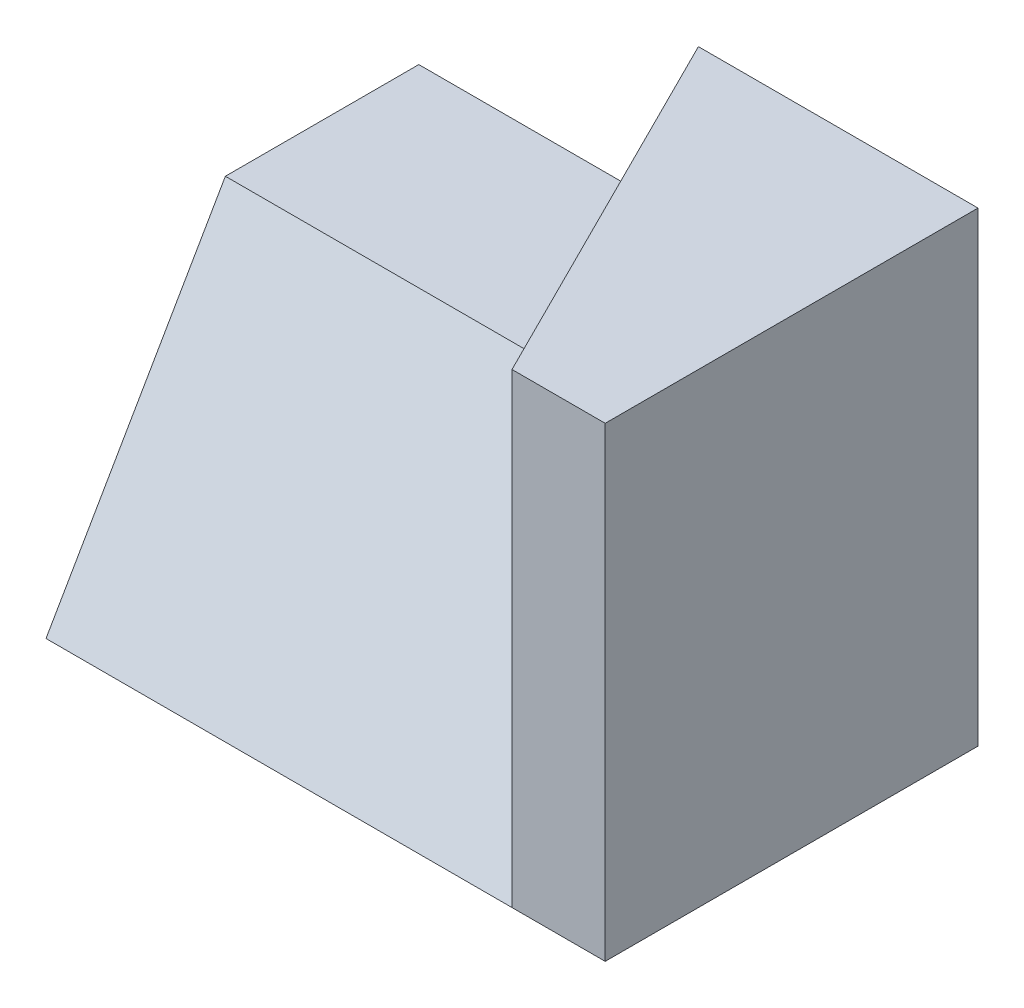
ISO-10303-21;
HEADER;
FILE_DESCRIPTION(('STEP AP214'),'2;1');
FILE_NAME('part.step','',(''),(''),'','','');
FILE_SCHEMA(('AUTOMOTIVE_DESIGN { 1 0 10303 214 1 1 1 1 }'));
ENDSEC;
DATA;
#1=APPLICATION_CONTEXT('core data for automotive mechanical design processes');
#2=APPLICATION_PROTOCOL_DEFINITION('international standard','automotive_design',2000,#1);
#3=PRODUCT_CONTEXT('',#1,'mechanical');
#4=PRODUCT('Part','Part','',(#3));
#5=PRODUCT_RELATED_PRODUCT_CATEGORY('part','',(#4));
#6=PRODUCT_DEFINITION_FORMATION('','',#4);
#7=PRODUCT_DEFINITION_CONTEXT('part definition',#1,'design');
#8=PRODUCT_DEFINITION('design','',#6,#7);
#9=PRODUCT_DEFINITION_SHAPE('','',#8);
#10=(LENGTH_UNIT() NAMED_UNIT(*) SI_UNIT(.MILLI.,.METRE.));
#11=(NAMED_UNIT(*) PLANE_ANGLE_UNIT() SI_UNIT($,.RADIAN.));
#12=(NAMED_UNIT(*) SI_UNIT($,.STERADIAN.) SOLID_ANGLE_UNIT());
#13=UNCERTAINTY_MEASURE_WITH_UNIT(LENGTH_MEASURE(1.E-05),#10,'distance_accuracy_value','');
#14=(GEOMETRIC_REPRESENTATION_CONTEXT(3) GLOBAL_UNCERTAINTY_ASSIGNED_CONTEXT((#13)) GLOBAL_UNIT_ASSIGNED_CONTEXT((#10,
#11,#12)) REPRESENTATION_CONTEXT('',''));
#15=CARTESIAN_POINT('',(0.,0.,0.));
#16=DIRECTION('',(0.,0.,1.));
#17=DIRECTION('',(1.,0.,0.));
#18=AXIS2_PLACEMENT_3D('',#15,#16,#17);
#19=CARTESIAN_POINT('',(0.,50.,-60.));
#20=DIRECTION('',(0.,-1.,0.));
#21=DIRECTION('',(0.,0.,-1.));
#22=AXIS2_PLACEMENT_3D('',#19,#20,#21);
#23=PLANE('',#22);
#24=DIRECTION('',(0.447213595499958,0.,0.894427190999916));
#25=VECTOR('',#24,1.);
#26=CARTESIAN_POINT('',(36.,50.,-78.));
#27=LINE('',#26,#25);
#28=CARTESIAN_POINT('',(45.,50.,-60.));
#29=VERTEX_POINT('',#28);
#30=CARTESIAN_POINT('',(60.5662432702594,50.,-28.8675134594811));
#31=VERTEX_POINT('',#30);
#32=EDGE_CURVE('E46',#29,#31,#27,.T.);
#33=ORIENTED_EDGE('',*,*,#32,.F.);
#34=DIRECTION('',(-1.,0.,0.));
#35=VECTOR('',#34,1.);
#36=CARTESIAN_POINT('',(0.,50.,-60.));
#37=LINE('',#36,#35);
#38=CARTESIAN_POINT('',(0.,50.,-60.));
#39=VERTEX_POINT('',#38);
#40=EDGE_CURVE('E111',#29,#39,#37,.T.);
#41=ORIENTED_EDGE('',*,*,#40,.T.);
#42=DIRECTION('',(0.,0.,1.));
#43=VECTOR('',#42,1.);
#44=CARTESIAN_POINT('',(0.,50.,0.));
#45=LINE('',#44,#43);
#46=CARTESIAN_POINT('',(0.,50.,-28.8675134594811));
#47=VERTEX_POINT('',#46);
#48=EDGE_CURVE('E124',#39,#47,#45,.T.);
#49=ORIENTED_EDGE('',*,*,#48,.T.);
#50=DIRECTION('',(1.,0.,0.));
#51=VECTOR('',#50,1.);
#52=CARTESIAN_POINT('',(0.,50.,-28.8675134594811));
#53=LINE('',#52,#51);
#54=EDGE_CURVE('E121',#47,#31,#53,.T.);
#55=ORIENTED_EDGE('',*,*,#54,.T.);
#56=EDGE_LOOP('',(#33,#41,#49,#55));
#57=FACE_BOUND('',#56,.T.);
#58=ADVANCED_FACE('F31',(#57),#23,.F.);
#59=CARTESIAN_POINT('',(0.,0.,0.));
#60=DIRECTION('',(0.,-0.499999999999998,-0.86602540378444));
#61=DIRECTION('',(0.,0.86602540378444,-0.499999999999998));
#62=AXIS2_PLACEMENT_3D('',#59,#60,#61);
#63=PLANE('',#62);
#64=DIRECTION('',(0.242535625036332,-0.840168050416807,0.485071250072664));
#65=VECTOR('',#64,1.);
#66=CARTESIAN_POINT('',(70.5882352941177,15.2828012432548,-8.82352941176463));
#67=LINE('',#66,#65);
#68=CARTESIAN_POINT('',(75.,0.,0.));
#69=VERTEX_POINT('',#68);
#70=EDGE_CURVE('E11',#31,#69,#67,.T.);
#71=ORIENTED_EDGE('',*,*,#70,.F.);
#72=ORIENTED_EDGE('',*,*,#54,.F.);
#73=DIRECTION('',(0.,0.86602540378444,-0.499999999999998));
#74=VECTOR('',#73,1.);
#75=CARTESIAN_POINT('',(0.,0.,0.));
#76=LINE('',#75,#74);
#77=CARTESIAN_POINT('',(0.,0.,0.));
#78=VERTEX_POINT('',#77);
#79=EDGE_CURVE('E113',#78,#47,#76,.T.);
#80=ORIENTED_EDGE('',*,*,#79,.F.);
#81=DIRECTION('',(1.,0.,0.));
#82=VECTOR('',#81,1.);
#83=CARTESIAN_POINT('',(0.,0.,0.));
#84=LINE('',#83,#82);
#85=EDGE_CURVE('E132',#78,#69,#84,.T.);
#86=ORIENTED_EDGE('',*,*,#85,.T.);
#87=EDGE_LOOP('',(#71,#72,#80,#86));
#88=FACE_BOUND('',#87,.T.);
#89=ADVANCED_FACE('F159',(#88),#63,.F.);
#90=CARTESIAN_POINT('',(0.,50.,0.));
#91=DIRECTION('',(1.,0.,0.));
#92=DIRECTION('',(0.,0.,-1.));
#93=AXIS2_PLACEMENT_3D('',#90,#91,#92);
#94=PLANE('',#93);
#95=DIRECTION('',(0.,0.,1.));
#96=VECTOR('',#95,1.);
#97=CARTESIAN_POINT('',(0.,0.,0.));
#98=LINE('',#97,#96);
#99=CARTESIAN_POINT('',(0.,0.,-60.));
#100=VERTEX_POINT('',#99);
#101=EDGE_CURVE('E123',#100,#78,#98,.T.);
#102=ORIENTED_EDGE('',*,*,#101,.T.);
#103=ORIENTED_EDGE('',*,*,#79,.T.);
#104=ORIENTED_EDGE('',*,*,#48,.F.);
#105=DIRECTION('',(0.,-1.,0.));
#106=VECTOR('',#105,1.);
#107=CARTESIAN_POINT('',(0.,50.,-60.));
#108=LINE('',#107,#106);
#109=EDGE_CURVE('E129',#39,#100,#108,.T.);
#110=ORIENTED_EDGE('',*,*,#109,.T.);
#111=EDGE_LOOP('',(#102,#103,#104,#110));
#112=FACE_BOUND('',#111,.T.);
#113=ADVANCED_FACE('F33',(#112),#94,.F.);
#114=CARTESIAN_POINT('',(90.,50.,0.));
#115=DIRECTION('',(-1.,0.,0.));
#116=DIRECTION('',(0.,0.,1.));
#117=AXIS2_PLACEMENT_3D('',#114,#115,#116);
#118=PLANE('',#117);
#119=DIRECTION('',(0.,-1.,0.));
#120=VECTOR('',#119,1.);
#121=CARTESIAN_POINT('',(90.,50.,-60.));
#122=LINE('',#121,#120);
#123=CARTESIAN_POINT('',(90.,75.,-60.));
#124=VERTEX_POINT('',#123);
#125=CARTESIAN_POINT('',(90.,0.,-60.));
#126=VERTEX_POINT('',#125);
#127=EDGE_CURVE('E39',#124,#126,#122,.T.);
#128=ORIENTED_EDGE('',*,*,#127,.F.);
#129=DIRECTION('',(0.,0.,-1.));
#130=VECTOR('',#129,1.);
#131=CARTESIAN_POINT('',(90.,75.,-60.));
#132=LINE('',#131,#130);
#133=CARTESIAN_POINT('',(90.,75.,0.));
#134=VERTEX_POINT('',#133);
#135=EDGE_CURVE('E105',#134,#124,#132,.T.);
#136=ORIENTED_EDGE('',*,*,#135,.F.);
#137=DIRECTION('',(0.,-1.,0.));
#138=VECTOR('',#137,1.);
#139=CARTESIAN_POINT('',(90.,75.,0.));
#140=LINE('',#139,#138);
#141=CARTESIAN_POINT('',(90.,0.,0.));
#142=VERTEX_POINT('',#141);
#143=EDGE_CURVE('E115',#134,#142,#140,.T.);
#144=ORIENTED_EDGE('',*,*,#143,.T.);
#145=DIRECTION('',(0.,0.,-1.));
#146=VECTOR('',#145,1.);
#147=CARTESIAN_POINT('',(90.,0.,0.));
#148=LINE('',#147,#146);
#149=EDGE_CURVE('E134',#142,#126,#148,.T.);
#150=ORIENTED_EDGE('',*,*,#149,.T.);
#151=EDGE_LOOP('',(#128,#136,#144,#150));
#152=FACE_BOUND('',#151,.T.);
#153=ADVANCED_FACE('F152',(#152),#118,.F.);
#154=CARTESIAN_POINT('',(0.,50.,-60.));
#155=DIRECTION('',(0.,0.,1.));
#156=DIRECTION('',(1.,0.,0.));
#157=AXIS2_PLACEMENT_3D('',#154,#155,#156);
#158=PLANE('',#157);
#159=DIRECTION('',(-1.,0.,0.));
#160=VECTOR('',#159,1.);
#161=CARTESIAN_POINT('',(0.,0.,-60.));
#162=LINE('',#161,#160);
#163=EDGE_CURVE('E127',#126,#100,#162,.T.);
#164=ORIENTED_EDGE('',*,*,#163,.T.);
#165=ORIENTED_EDGE('',*,*,#109,.F.);
#166=ORIENTED_EDGE('',*,*,#40,.F.);
#167=DIRECTION('',(0.,-1.,0.));
#168=VECTOR('',#167,1.);
#169=CARTESIAN_POINT('',(45.,75.,-60.));
#170=LINE('',#169,#168);
#171=CARTESIAN_POINT('',(45.,75.,-60.));
#172=VERTEX_POINT('',#171);
#173=EDGE_CURVE('E93',#172,#29,#170,.T.);
#174=ORIENTED_EDGE('',*,*,#173,.F.);
#175=DIRECTION('',(-1.,0.,0.));
#176=VECTOR('',#175,1.);
#177=CARTESIAN_POINT('',(45.,75.,-60.));
#178=LINE('',#177,#176);
#179=EDGE_CURVE('E99',#124,#172,#178,.T.);
#180=ORIENTED_EDGE('',*,*,#179,.F.);
#181=ORIENTED_EDGE('',*,*,#127,.T.);
#182=EDGE_LOOP('',(#164,#165,#166,#174,#180,#181));
#183=FACE_BOUND('',#182,.T.);
#184=ADVANCED_FACE('F109',(#183),#158,.F.);
#185=CARTESIAN_POINT('',(0.,0.,-60.));
#186=DIRECTION('',(0.,-1.,0.));
#187=DIRECTION('',(0.,0.,-1.));
#188=AXIS2_PLACEMENT_3D('',#185,#186,#187);
#189=PLANE('',#188);
#190=DIRECTION('',(1.,0.,0.));
#191=VECTOR('',#190,1.);
#192=CARTESIAN_POINT('',(90.,0.,0.));
#193=LINE('',#192,#191);
#194=EDGE_CURVE('E54',#69,#142,#193,.T.);
#195=ORIENTED_EDGE('',*,*,#194,.F.);
#196=ORIENTED_EDGE('',*,*,#85,.F.);
#197=ORIENTED_EDGE('',*,*,#101,.F.);
#198=ORIENTED_EDGE('',*,*,#163,.F.);
#199=ORIENTED_EDGE('',*,*,#149,.F.);
#200=EDGE_LOOP('',(#195,#196,#197,#198,#199));
#201=FACE_BOUND('',#200,.T.);
#202=ADVANCED_FACE('F141',(#201),#189,.T.);
#203=CARTESIAN_POINT('',(75.,75.,0.));
#204=DIRECTION('',(0.894427190999916,0.,-0.447213595499958));
#205=DIRECTION('',(-0.447213595499958,0.,-0.894427190999916));
#206=AXIS2_PLACEMENT_3D('',#203,#204,#205);
#207=PLANE('',#206);
#208=ORIENTED_EDGE('',*,*,#173,.T.);
#209=ORIENTED_EDGE('',*,*,#32,.T.);
#210=ORIENTED_EDGE('',*,*,#70,.T.);
#211=DIRECTION('',(0.,-1.,0.));
#212=VECTOR('',#211,1.);
#213=CARTESIAN_POINT('',(75.,75.,0.));
#214=LINE('',#213,#212);
#215=CARTESIAN_POINT('',(75.,75.,0.));
#216=VERTEX_POINT('',#215);
#217=EDGE_CURVE('E95',#216,#69,#214,.T.);
#218=ORIENTED_EDGE('',*,*,#217,.F.);
#219=DIRECTION('',(0.447213595499958,0.,0.894427190999916));
#220=VECTOR('',#219,1.);
#221=CARTESIAN_POINT('',(75.,75.,0.));
#222=LINE('',#221,#220);
#223=EDGE_CURVE('E89',#172,#216,#222,.T.);
#224=ORIENTED_EDGE('',*,*,#223,.F.);
#225=EDGE_LOOP('',(#208,#209,#210,#218,#224));
#226=FACE_BOUND('',#225,.T.);
#227=ADVANCED_FACE('F91',(#226),#207,.F.);
#228=CARTESIAN_POINT('',(90.,75.,0.));
#229=DIRECTION('',(0.,0.,-1.));
#230=DIRECTION('',(-1.,0.,0.));
#231=AXIS2_PLACEMENT_3D('',#228,#229,#230);
#232=PLANE('',#231);
#233=ORIENTED_EDGE('',*,*,#194,.T.);
#234=ORIENTED_EDGE('',*,*,#143,.F.);
#235=DIRECTION('',(1.,0.,0.));
#236=VECTOR('',#235,1.);
#237=CARTESIAN_POINT('',(90.,75.,0.));
#238=LINE('',#237,#236);
#239=EDGE_CURVE('E98',#216,#134,#238,.T.);
#240=ORIENTED_EDGE('',*,*,#239,.F.);
#241=ORIENTED_EDGE('',*,*,#217,.T.);
#242=EDGE_LOOP('',(#233,#234,#240,#241));
#243=FACE_BOUND('',#242,.T.);
#244=ADVANCED_FACE('F146',(#243),#232,.F.);
#245=CARTESIAN_POINT('',(90.,75.,-60.));
#246=DIRECTION('',(0.,-1.,0.));
#247=DIRECTION('',(0.,0.,-1.));
#248=AXIS2_PLACEMENT_3D('',#245,#246,#247);
#249=PLANE('',#248);
#250=ORIENTED_EDGE('',*,*,#179,.T.);
#251=ORIENTED_EDGE('',*,*,#223,.T.);
#252=ORIENTED_EDGE('',*,*,#239,.T.);
#253=ORIENTED_EDGE('',*,*,#135,.T.);
#254=EDGE_LOOP('',(#250,#251,#252,#253));
#255=FACE_BOUND('',#254,.T.);
#256=ADVANCED_FACE('F103',(#255),#249,.F.);
#257=CLOSED_SHELL('',(#58,#89,#113,#153,#184,#202,#227,#244,#256));
#258=MANIFOLD_SOLID_BREP('B2',#257);
#259=ADVANCED_BREP_SHAPE_REPRESENTATION('',(#18,#258),#14);
#260=SHAPE_DEFINITION_REPRESENTATION(#9,#259);
ENDSEC;
END-ISO-10303-21;
